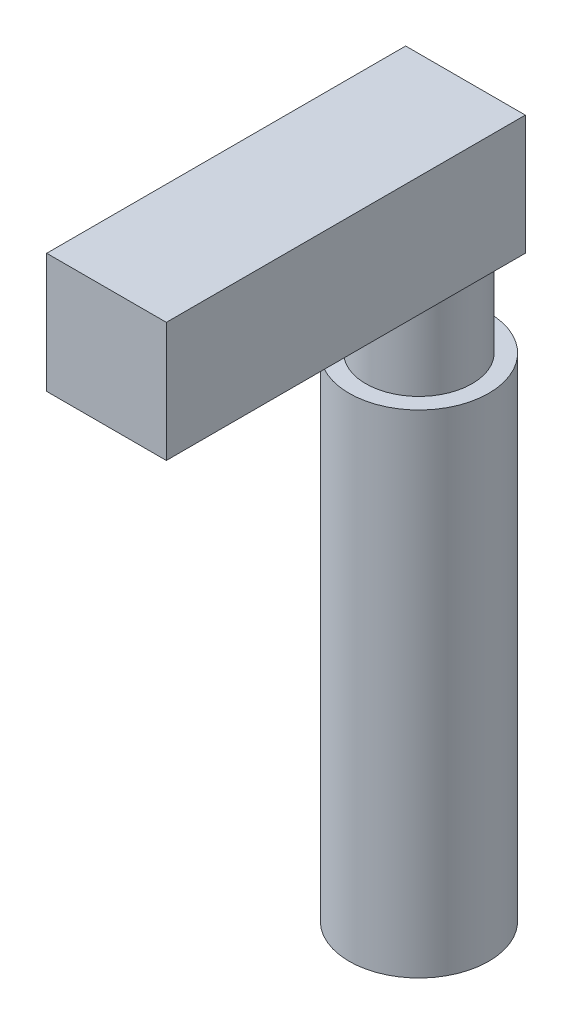
ISO-10303-21;
HEADER;
FILE_DESCRIPTION(('STEP AP214'),'2;1');
FILE_NAME('part.step','',(''),(''),'','','');
FILE_SCHEMA(('AUTOMOTIVE_DESIGN { 1 0 10303 214 1 1 1 1 }'));
ENDSEC;
DATA;
#1=APPLICATION_CONTEXT('core data for automotive mechanical design processes');
#2=APPLICATION_PROTOCOL_DEFINITION('international standard','automotive_design',2000,#1);
#3=PRODUCT_CONTEXT('',#1,'mechanical');
#4=PRODUCT('Part','Part','',(#3));
#5=PRODUCT_RELATED_PRODUCT_CATEGORY('part','',(#4));
#6=PRODUCT_DEFINITION_FORMATION('','',#4);
#7=PRODUCT_DEFINITION_CONTEXT('part definition',#1,'design');
#8=PRODUCT_DEFINITION('design','',#6,#7);
#9=PRODUCT_DEFINITION_SHAPE('','',#8);
#10=(LENGTH_UNIT() NAMED_UNIT(*) SI_UNIT(.MILLI.,.METRE.));
#11=(NAMED_UNIT(*) PLANE_ANGLE_UNIT() SI_UNIT($,.RADIAN.));
#12=(NAMED_UNIT(*) SI_UNIT($,.STERADIAN.) SOLID_ANGLE_UNIT());
#13=UNCERTAINTY_MEASURE_WITH_UNIT(LENGTH_MEASURE(1.E-05),#10,'distance_accuracy_value','');
#14=(GEOMETRIC_REPRESENTATION_CONTEXT(3) GLOBAL_UNCERTAINTY_ASSIGNED_CONTEXT((#13)) GLOBAL_UNIT_ASSIGNED_CONTEXT((#10,
#11,#12)) REPRESENTATION_CONTEXT('',''));
#15=CARTESIAN_POINT('',(0.,0.,0.));
#16=DIRECTION('',(0.,0.,1.));
#17=DIRECTION('',(1.,0.,0.));
#18=AXIS2_PLACEMENT_3D('',#15,#16,#17);
#19=CARTESIAN_POINT('',(0.,0.,27.));
#20=DIRECTION('',(-1.,0.,0.));
#21=DIRECTION('',(0.,0.,1.));
#22=AXIS2_PLACEMENT_3D('',#19,#20,#21);
#23=PLANE('',#22);
#24=DIRECTION('',(0.,1.,0.));
#25=VECTOR('',#24,1.);
#26=CARTESIAN_POINT('',(0.,0.,0.));
#27=LINE('',#26,#25);
#28=CARTESIAN_POINT('',(0.,0.,0.));
#29=VERTEX_POINT('',#28);
#30=CARTESIAN_POINT('',(0.,9.,0.));
#31=VERTEX_POINT('',#30);
#32=EDGE_CURVE('E109',#29,#31,#27,.T.);
#33=ORIENTED_EDGE('',*,*,#32,.T.);
#34=DIRECTION('',(0.,0.,-1.));
#35=VECTOR('',#34,1.);
#36=CARTESIAN_POINT('',(0.,9.,27.));
#37=LINE('',#36,#35);
#38=CARTESIAN_POINT('',(0.,9.,27.));
#39=VERTEX_POINT('',#38);
#40=EDGE_CURVE('E38',#39,#31,#37,.T.);
#41=ORIENTED_EDGE('',*,*,#40,.F.);
#42=DIRECTION('',(0.,1.,0.));
#43=VECTOR('',#42,1.);
#44=CARTESIAN_POINT('',(0.,0.,27.));
#45=LINE('',#44,#43);
#46=CARTESIAN_POINT('',(0.,0.,27.));
#47=VERTEX_POINT('',#46);
#48=EDGE_CURVE('E94',#47,#39,#45,.T.);
#49=ORIENTED_EDGE('',*,*,#48,.F.);
#50=DIRECTION('',(0.,0.,-1.));
#51=VECTOR('',#50,1.);
#52=CARTESIAN_POINT('',(0.,0.,27.));
#53=LINE('',#52,#51);
#54=EDGE_CURVE('E121',#47,#29,#53,.T.);
#55=ORIENTED_EDGE('',*,*,#54,.T.);
#56=EDGE_LOOP('',(#33,#41,#49,#55));
#57=FACE_BOUND('',#56,.T.);
#58=ADVANCED_FACE('F35',(#57),#23,.F.);
#59=CARTESIAN_POINT('',(0.,9.,27.));
#60=DIRECTION('',(0.,-1.,0.));
#61=DIRECTION('',(1.,0.,0.));
#62=AXIS2_PLACEMENT_3D('',#59,#60,#61);
#63=PLANE('',#62);
#64=DIRECTION('',(-1.,0.,0.));
#65=VECTOR('',#64,1.);
#66=CARTESIAN_POINT('',(0.,9.,0.));
#67=LINE('',#66,#65);
#68=CARTESIAN_POINT('',(-9.,9.,0.));
#69=VERTEX_POINT('',#68);
#70=EDGE_CURVE('E124',#31,#69,#67,.T.);
#71=ORIENTED_EDGE('',*,*,#70,.T.);
#72=DIRECTION('',(0.,0.,-1.));
#73=VECTOR('',#72,1.);
#74=CARTESIAN_POINT('',(-9.,9.,27.));
#75=LINE('',#74,#73);
#76=CARTESIAN_POINT('',(-9.,9.,27.));
#77=VERTEX_POINT('',#76);
#78=EDGE_CURVE('E129',#77,#69,#75,.T.);
#79=ORIENTED_EDGE('',*,*,#78,.F.);
#80=DIRECTION('',(-1.,0.,0.));
#81=VECTOR('',#80,1.);
#82=CARTESIAN_POINT('',(0.,9.,27.));
#83=LINE('',#82,#81);
#84=EDGE_CURVE('E83',#39,#77,#83,.T.);
#85=ORIENTED_EDGE('',*,*,#84,.F.);
#86=ORIENTED_EDGE('',*,*,#40,.T.);
#87=EDGE_LOOP('',(#71,#79,#85,#86));
#88=FACE_BOUND('',#87,.T.);
#89=ADVANCED_FACE('F134',(#88),#63,.F.);
#90=CARTESIAN_POINT('',(-9.,0.,27.));
#91=DIRECTION('',(1.,0.,0.));
#92=DIRECTION('',(0.,0.,-1.));
#93=AXIS2_PLACEMENT_3D('',#90,#91,#92);
#94=PLANE('',#93);
#95=DIRECTION('',(0.,-1.,0.));
#96=VECTOR('',#95,1.);
#97=CARTESIAN_POINT('',(-9.,0.,0.));
#98=LINE('',#97,#96);
#99=CARTESIAN_POINT('',(-9.,0.,0.));
#100=VERTEX_POINT('',#99);
#101=EDGE_CURVE('E126',#69,#100,#98,.T.);
#102=ORIENTED_EDGE('',*,*,#101,.T.);
#103=DIRECTION('',(0.,0.,-1.));
#104=VECTOR('',#103,1.);
#105=CARTESIAN_POINT('',(-9.,0.,27.));
#106=LINE('',#105,#104);
#107=CARTESIAN_POINT('',(-9.,0.,27.));
#108=VERTEX_POINT('',#107);
#109=EDGE_CURVE('E91',#108,#100,#106,.T.);
#110=ORIENTED_EDGE('',*,*,#109,.F.);
#111=DIRECTION('',(0.,-1.,0.));
#112=VECTOR('',#111,1.);
#113=CARTESIAN_POINT('',(-9.,0.,27.));
#114=LINE('',#113,#112);
#115=EDGE_CURVE('E118',#77,#108,#114,.T.);
#116=ORIENTED_EDGE('',*,*,#115,.F.);
#117=ORIENTED_EDGE('',*,*,#78,.T.);
#118=EDGE_LOOP('',(#102,#110,#116,#117));
#119=FACE_BOUND('',#118,.T.);
#120=ADVANCED_FACE('F137',(#119),#94,.F.);
#121=CARTESIAN_POINT('',(0.,0.,27.));
#122=DIRECTION('',(0.,1.,0.));
#123=DIRECTION('',(-1.,0.,0.));
#124=AXIS2_PLACEMENT_3D('',#121,#122,#123);
#125=PLANE('',#124);
#126=CARTESIAN_POINT('',(-4.5,0.,3.5));
#127=DIRECTION('',(0.,-1.,0.));
#128=DIRECTION('',(1.,0.,0.));
#129=AXIS2_PLACEMENT_3D('',#126,#127,#128);
#130=CIRCLE('',#129,4.);
#131=CARTESIAN_POINT('',(-2.56350832689629,0.,0.));
#132=VERTEX_POINT('',#131);
#133=CARTESIAN_POINT('',(-6.43649167310371,0.,0.));
#134=VERTEX_POINT('',#133);
#135=EDGE_CURVE('E11',#132,#134,#130,.T.);
#136=ORIENTED_EDGE('',*,*,#135,.F.);
#137=DIRECTION('',(1.,0.,0.));
#138=VECTOR('',#137,1.);
#139=CARTESIAN_POINT('',(0.,0.,0.));
#140=LINE('',#139,#138);
#141=EDGE_CURVE('E75',#132,#29,#140,.T.);
#142=ORIENTED_EDGE('',*,*,#141,.T.);
#143=ORIENTED_EDGE('',*,*,#54,.F.);
#144=DIRECTION('',(1.,0.,0.));
#145=VECTOR('',#144,1.);
#146=CARTESIAN_POINT('',(0.,0.,27.));
#147=LINE('',#146,#145);
#148=EDGE_CURVE('E58',#108,#47,#147,.T.);
#149=ORIENTED_EDGE('',*,*,#148,.F.);
#150=ORIENTED_EDGE('',*,*,#109,.T.);
#151=EDGE_CURVE('E87',#100,#134,#140,.T.);
#152=ORIENTED_EDGE('',*,*,#151,.T.);
#153=EDGE_LOOP('',(#136,#142,#143,#149,#150,#152));
#154=FACE_BOUND('',#153,.T.);
#155=ADVANCED_FACE('F89',(#154),#125,.F.);
#156=CARTESIAN_POINT('',(0.,0.,27.));
#157=DIRECTION('',(0.,0.,1.));
#158=DIRECTION('',(1.,0.,0.));
#159=AXIS2_PLACEMENT_3D('',#156,#157,#158);
#160=PLANE('',#159);
#161=ORIENTED_EDGE('',*,*,#48,.T.);
#162=ORIENTED_EDGE('',*,*,#84,.T.);
#163=ORIENTED_EDGE('',*,*,#115,.T.);
#164=ORIENTED_EDGE('',*,*,#148,.T.);
#165=EDGE_LOOP('',(#161,#162,#163,#164));
#166=FACE_BOUND('',#165,.T.);
#167=ADVANCED_FACE('F138',(#166),#160,.T.);
#168=CARTESIAN_POINT('',(0.,0.,0.));
#169=DIRECTION('',(0.,0.,1.));
#170=DIRECTION('',(1.,0.,0.));
#171=AXIS2_PLACEMENT_3D('',#168,#169,#170);
#172=PLANE('',#171);
#173=ORIENTED_EDGE('',*,*,#32,.F.);
#174=ORIENTED_EDGE('',*,*,#141,.F.);
#175=EDGE_CURVE('E95',#134,#132,#140,.T.);
#176=ORIENTED_EDGE('',*,*,#175,.F.);
#177=ORIENTED_EDGE('',*,*,#151,.F.);
#178=ORIENTED_EDGE('',*,*,#101,.F.);
#179=ORIENTED_EDGE('',*,*,#70,.F.);
#180=EDGE_LOOP('',(#173,#174,#176,#177,#178,#179));
#181=FACE_BOUND('',#180,.T.);
#182=ADVANCED_FACE('F99',(#181),#172,.F.);
#183=CARTESIAN_POINT('',(-4.5,0.,3.5));
#184=DIRECTION('',(0.,-1.,0.));
#185=DIRECTION('',(1.,0.,0.));
#186=AXIS2_PLACEMENT_3D('',#183,#184,#185);
#187=PLANE('',#186);
#188=EDGE_CURVE('E44',#134,#132,#130,.T.);
#189=ORIENTED_EDGE('',*,*,#188,.F.);
#190=ORIENTED_EDGE('',*,*,#175,.T.);
#191=EDGE_LOOP('',(#189,#190));
#192=FACE_BOUND('',#191,.T.);
#193=ADVANCED_FACE('F105',(#192),#187,.F.);
#194=CARTESIAN_POINT('',(-4.5,-7.,3.5));
#195=DIRECTION('',(0.,1.,0.));
#196=DIRECTION('',(-1.,0.,0.));
#197=AXIS2_PLACEMENT_3D('',#194,#195,#196);
#198=CYLINDRICAL_SURFACE('',#197,4.);
#199=CARTESIAN_POINT('',(-4.5,-7.,3.5));
#200=DIRECTION('',(0.,-1.,0.));
#201=DIRECTION('',(1.,0.,0.));
#202=AXIS2_PLACEMENT_3D('',#199,#200,#201);
#203=CIRCLE('',#202,4.);
#204=CARTESIAN_POINT('',(-0.499999999999999,-7.,3.5));
#205=VERTEX_POINT('',#204);
#206=EDGE_CURVE('E106',#205,#205,#203,.T.);
#207=ORIENTED_EDGE('',*,*,#206,.F.);
#208=EDGE_LOOP('',(#207));
#209=FACE_BOUND('',#208,.T.);
#210=ORIENTED_EDGE('',*,*,#188,.T.);
#211=ORIENTED_EDGE('',*,*,#135,.T.);
#212=EDGE_LOOP('',(#210,#211));
#213=FACE_BOUND('',#212,.T.);
#214=ADVANCED_FACE('F104',(#209,#213),#198,.T.);
#215=CARTESIAN_POINT('',(-4.49999999999999,-44.,3.5));
#216=DIRECTION('',(0.,1.,0.));
#217=DIRECTION('',(-1.,0.,0.));
#218=AXIS2_PLACEMENT_3D('',#215,#216,#217);
#219=CYLINDRICAL_SURFACE('',#218,5.25);
#220=CARTESIAN_POINT('',(-4.49999999999999,-44.,3.5));
#221=DIRECTION('',(0.,-1.,0.));
#222=DIRECTION('',(1.,0.,0.));
#223=AXIS2_PLACEMENT_3D('',#220,#221,#222);
#224=CIRCLE('',#223,5.25);
#225=CARTESIAN_POINT('',(0.750000000000006,-44.,3.5));
#226=VERTEX_POINT('',#225);
#227=EDGE_CURVE('E107',#226,#226,#224,.T.);
#228=ORIENTED_EDGE('',*,*,#227,.F.);
#229=EDGE_LOOP('',(#228));
#230=FACE_BOUND('',#229,.T.);
#231=CARTESIAN_POINT('',(-4.5,-7.,3.5));
#232=DIRECTION('',(0.,-1.,0.));
#233=DIRECTION('',(1.,0.,0.));
#234=AXIS2_PLACEMENT_3D('',#231,#232,#233);
#235=CIRCLE('',#234,5.25);
#236=CARTESIAN_POINT('',(0.750000000000002,-7.,3.5));
#237=VERTEX_POINT('',#236);
#238=EDGE_CURVE('E112',#237,#237,#235,.T.);
#239=ORIENTED_EDGE('',*,*,#238,.T.);
#240=EDGE_LOOP('',(#239));
#241=FACE_BOUND('',#240,.T.);
#242=ADVANCED_FACE('F187',(#230,#241),#219,.T.);
#243=CARTESIAN_POINT('',(-4.49999999999999,-44.,3.5));
#244=DIRECTION('',(0.,-1.,0.));
#245=DIRECTION('',(1.,0.,0.));
#246=AXIS2_PLACEMENT_3D('',#243,#244,#245);
#247=PLANE('',#246);
#248=ORIENTED_EDGE('',*,*,#227,.T.);
#249=EDGE_LOOP('',(#248));
#250=FACE_BOUND('',#249,.T.);
#251=ADVANCED_FACE('F196',(#250),#247,.T.);
#252=CARTESIAN_POINT('',(-4.5,-7.,3.5));
#253=DIRECTION('',(0.,-1.,0.));
#254=DIRECTION('',(1.,0.,0.));
#255=AXIS2_PLACEMENT_3D('',#252,#253,#254);
#256=PLANE('',#255);
#257=ORIENTED_EDGE('',*,*,#206,.T.);
#258=EDGE_LOOP('',(#257));
#259=FACE_BOUND('',#258,.T.);
#260=ORIENTED_EDGE('',*,*,#238,.F.);
#261=EDGE_LOOP('',(#260));
#262=FACE_BOUND('',#261,.T.);
#263=ADVANCED_FACE('F206',(#259,#262),#256,.F.);
#264=CLOSED_SHELL('',(#58,#89,#120,#155,#167,#182,#193,#214,#242,#251,#263));
#265=MANIFOLD_SOLID_BREP('B2',#264);
#266=ADVANCED_BREP_SHAPE_REPRESENTATION('',(#18,#265),#14);
#267=SHAPE_DEFINITION_REPRESENTATION(#9,#266);
ENDSEC;
END-ISO-10303-21;
